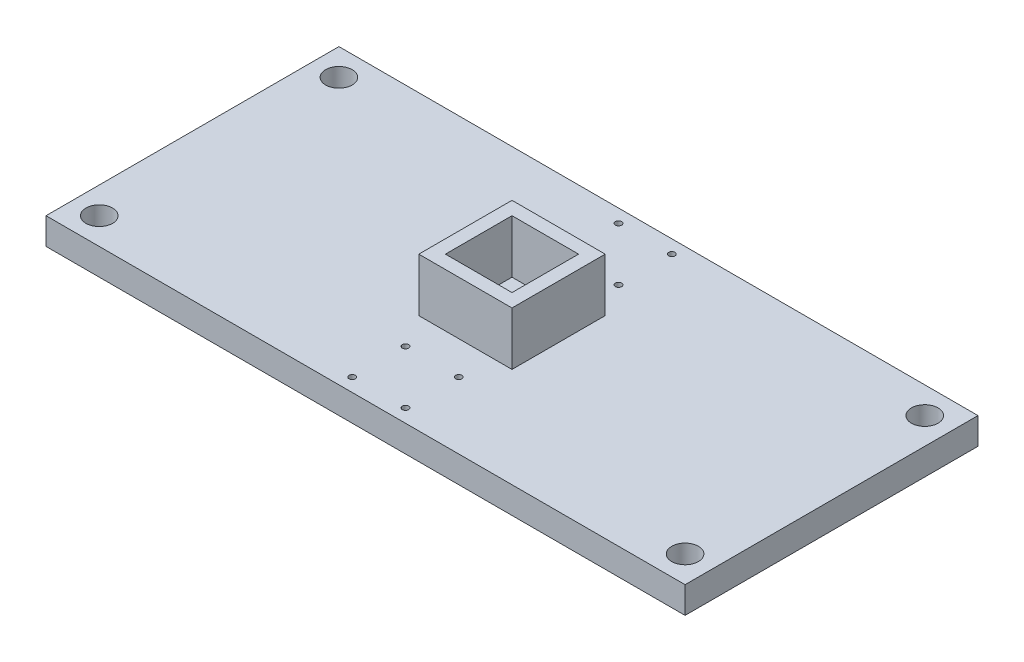
ISO-10303-21;
HEADER;
FILE_DESCRIPTION(('STEP AP214'),'2;1');
FILE_NAME('part.step','',(''),(''),'','','');
FILE_SCHEMA(('AUTOMOTIVE_DESIGN { 1 0 10303 214 1 1 1 1 }'));
ENDSEC;
DATA;
#1=APPLICATION_CONTEXT('core data for automotive mechanical design processes');
#2=APPLICATION_PROTOCOL_DEFINITION('international standard','automotive_design',2000,#1);
#3=PRODUCT_CONTEXT('',#1,'mechanical');
#4=PRODUCT('Part','Part','',(#3));
#5=PRODUCT_RELATED_PRODUCT_CATEGORY('part','',(#4));
#6=PRODUCT_DEFINITION_FORMATION('','',#4);
#7=PRODUCT_DEFINITION_CONTEXT('part definition',#1,'design');
#8=PRODUCT_DEFINITION('design','',#6,#7);
#9=PRODUCT_DEFINITION_SHAPE('','',#8);
#10=(LENGTH_UNIT() NAMED_UNIT(*) SI_UNIT(.MILLI.,.METRE.));
#11=(NAMED_UNIT(*) PLANE_ANGLE_UNIT() SI_UNIT($,.RADIAN.));
#12=(NAMED_UNIT(*) SI_UNIT($,.STERADIAN.) SOLID_ANGLE_UNIT());
#13=UNCERTAINTY_MEASURE_WITH_UNIT(LENGTH_MEASURE(1.E-05),#10,'distance_accuracy_value','');
#14=(GEOMETRIC_REPRESENTATION_CONTEXT(3) GLOBAL_UNCERTAINTY_ASSIGNED_CONTEXT((#13)) GLOBAL_UNIT_ASSIGNED_CONTEXT((#10,
#11,#12)) REPRESENTATION_CONTEXT('',''));
#15=CARTESIAN_POINT('',(0.,0.,0.));
#16=DIRECTION('',(0.,0.,1.));
#17=DIRECTION('',(1.,0.,0.));
#18=AXIS2_PLACEMENT_3D('',#15,#16,#17);
#19=CARTESIAN_POINT('',(0.,12.7,0.));
#20=DIRECTION('',(0.,-1.,0.));
#21=DIRECTION('',(0.,0.,-1.));
#22=AXIS2_PLACEMENT_3D('',#19,#20,#21);
#23=PLANE('',#22);
#24=CARTESIAN_POINT('',(292.1,12.7,-127.));
#25=DIRECTION('',(0.,-1.,0.));
#26=DIRECTION('',(0.,0.,1.));
#27=AXIS2_PLACEMENT_3D('',#24,#25,#26);
#28=CIRCLE('',#27,6.34999999999994);
#29=CARTESIAN_POINT('',(292.1,12.7,-120.65));
#30=VERTEX_POINT('',#29);
#31=EDGE_CURVE('E475',#30,#30,#28,.T.);
#32=ORIENTED_EDGE('',*,*,#31,.T.);
#33=EDGE_LOOP('',(#32));
#34=FACE_BOUND('',#33,.T.);
#35=CARTESIAN_POINT('',(12.7,12.7,-127.));
#36=DIRECTION('',(0.,-1.,0.));
#37=DIRECTION('',(0.,0.,-1.));
#38=AXIS2_PLACEMENT_3D('',#35,#36,#37);
#39=CIRCLE('',#38,6.35);
#40=CARTESIAN_POINT('',(12.7,12.7,-133.35));
#41=VERTEX_POINT('',#40);
#42=EDGE_CURVE('E480',#41,#41,#39,.T.);
#43=ORIENTED_EDGE('',*,*,#42,.T.);
#44=EDGE_LOOP('',(#43));
#45=FACE_BOUND('',#44,.T.);
#46=CARTESIAN_POINT('',(139.7,12.7,-107.95));
#47=DIRECTION('',(0.,-1.,0.));
#48=DIRECTION('',(0.,0.,-1.));
#49=AXIS2_PLACEMENT_3D('',#46,#47,#48);
#50=CIRCLE('',#49,1.5);
#51=CARTESIAN_POINT('',(139.7,12.7,-109.45));
#52=VERTEX_POINT('',#51);
#53=EDGE_CURVE('E486',#52,#52,#50,.T.);
#54=ORIENTED_EDGE('',*,*,#53,.T.);
#55=EDGE_LOOP('',(#54));
#56=FACE_BOUND('',#55,.T.);
#57=CARTESIAN_POINT('',(165.1,12.7,-107.95));
#58=DIRECTION('',(0.,-1.,0.));
#59=DIRECTION('',(0.,0.,-1.));
#60=AXIS2_PLACEMENT_3D('',#57,#58,#59);
#61=CIRCLE('',#60,1.5);
#62=CARTESIAN_POINT('',(165.1,12.7,-109.45));
#63=VERTEX_POINT('',#62);
#64=EDGE_CURVE('E492',#63,#63,#61,.T.);
#65=ORIENTED_EDGE('',*,*,#64,.T.);
#66=EDGE_LOOP('',(#65));
#67=FACE_BOUND('',#66,.T.);
#68=CARTESIAN_POINT('',(165.1,12.7,-133.35));
#69=DIRECTION('',(0.,-1.,0.));
#70=DIRECTION('',(0.,0.,-1.));
#71=AXIS2_PLACEMENT_3D('',#68,#69,#70);
#72=CIRCLE('',#71,1.5);
#73=CARTESIAN_POINT('',(165.1,12.7,-134.85));
#74=VERTEX_POINT('',#73);
#75=EDGE_CURVE('E498',#74,#74,#72,.T.);
#76=ORIENTED_EDGE('',*,*,#75,.T.);
#77=EDGE_LOOP('',(#76));
#78=FACE_BOUND('',#77,.T.);
#79=CARTESIAN_POINT('',(139.7,12.7,-133.35));
#80=DIRECTION('',(0.,-1.,0.));
#81=DIRECTION('',(0.,0.,-1.));
#82=AXIS2_PLACEMENT_3D('',#79,#80,#81);
#83=CIRCLE('',#82,1.5);
#84=CARTESIAN_POINT('',(139.7,12.7,-134.85));
#85=VERTEX_POINT('',#84);
#86=EDGE_CURVE('E470',#85,#85,#83,.T.);
#87=ORIENTED_EDGE('',*,*,#86,.T.);
#88=EDGE_LOOP('',(#87));
#89=FACE_BOUND('',#88,.T.);
#90=CARTESIAN_POINT('',(292.1,12.7,-12.7));
#91=DIRECTION('',(0.,1.,0.));
#92=DIRECTION('',(0.,0.,-1.));
#93=AXIS2_PLACEMENT_3D('',#90,#91,#92);
#94=CIRCLE('',#93,6.34999999999994);
#95=CARTESIAN_POINT('',(292.1,12.7,-19.0499999999999));
#96=VERTEX_POINT('',#95);
#97=EDGE_CURVE('E223',#96,#96,#94,.T.);
#98=ORIENTED_EDGE('',*,*,#97,.F.);
#99=EDGE_LOOP('',(#98));
#100=FACE_BOUND('',#99,.T.);
#101=CARTESIAN_POINT('',(12.7,12.7,-12.7));
#102=DIRECTION('',(0.,1.,0.));
#103=DIRECTION('',(0.,0.,1.));
#104=AXIS2_PLACEMENT_3D('',#101,#102,#103);
#105=CIRCLE('',#104,6.35);
#106=CARTESIAN_POINT('',(12.7,12.7,-6.35));
#107=VERTEX_POINT('',#106);
#108=EDGE_CURVE('E253',#107,#107,#105,.T.);
#109=ORIENTED_EDGE('',*,*,#108,.F.);
#110=EDGE_LOOP('',(#109));
#111=FACE_BOUND('',#110,.T.);
#112=CARTESIAN_POINT('',(139.7,12.7,-31.75));
#113=DIRECTION('',(0.,1.,0.));
#114=DIRECTION('',(0.,0.,1.));
#115=AXIS2_PLACEMENT_3D('',#112,#113,#114);
#116=CIRCLE('',#115,1.5);
#117=CARTESIAN_POINT('',(139.7,12.7,-30.25));
#118=VERTEX_POINT('',#117);
#119=EDGE_CURVE('E245',#118,#118,#116,.T.);
#120=ORIENTED_EDGE('',*,*,#119,.F.);
#121=EDGE_LOOP('',(#120));
#122=FACE_BOUND('',#121,.T.);
#123=CARTESIAN_POINT('',(165.1,12.7,-31.75));
#124=DIRECTION('',(0.,1.,0.));
#125=DIRECTION('',(0.,0.,1.));
#126=AXIS2_PLACEMENT_3D('',#123,#124,#125);
#127=CIRCLE('',#126,1.5);
#128=CARTESIAN_POINT('',(165.1,12.7,-30.25));
#129=VERTEX_POINT('',#128);
#130=EDGE_CURVE('E237',#129,#129,#127,.T.);
#131=ORIENTED_EDGE('',*,*,#130,.F.);
#132=EDGE_LOOP('',(#131));
#133=FACE_BOUND('',#132,.T.);
#134=CARTESIAN_POINT('',(165.1,12.7,-6.35000000000001));
#135=DIRECTION('',(0.,1.,0.));
#136=DIRECTION('',(0.,0.,1.));
#137=AXIS2_PLACEMENT_3D('',#134,#135,#136);
#138=CIRCLE('',#137,1.5);
#139=CARTESIAN_POINT('',(165.1,12.7,-4.85000000000001));
#140=VERTEX_POINT('',#139);
#141=EDGE_CURVE('E229',#140,#140,#138,.T.);
#142=ORIENTED_EDGE('',*,*,#141,.F.);
#143=EDGE_LOOP('',(#142));
#144=FACE_BOUND('',#143,.T.);
#145=CARTESIAN_POINT('',(139.7,12.7,-6.35000000000001));
#146=DIRECTION('',(0.,1.,0.));
#147=DIRECTION('',(0.,0.,1.));
#148=AXIS2_PLACEMENT_3D('',#145,#146,#147);
#149=CIRCLE('',#148,1.5);
#150=CARTESIAN_POINT('',(139.7,12.7,-4.85000000000001));
#151=VERTEX_POINT('',#150);
#152=EDGE_CURVE('E228',#151,#151,#149,.T.);
#153=ORIENTED_EDGE('',*,*,#152,.F.);
#154=EDGE_LOOP('',(#153));
#155=FACE_BOUND('',#154,.T.);
#156=DIRECTION('',(0.,0.,1.));
#157=VECTOR('',#156,1.);
#158=CARTESIAN_POINT('',(0.,12.7,0.));
#159=LINE('',#158,#157);
#160=CARTESIAN_POINT('',(0.,12.7,-139.7));
#161=VERTEX_POINT('',#160);
#162=CARTESIAN_POINT('',(0.,12.7,0.));
#163=VERTEX_POINT('',#162);
#164=EDGE_CURVE('E272',#161,#163,#159,.T.);
#165=ORIENTED_EDGE('',*,*,#164,.T.);
#166=DIRECTION('',(1.,0.,0.));
#167=VECTOR('',#166,1.);
#168=CARTESIAN_POINT('',(0.,12.7,0.));
#169=LINE('',#168,#167);
#170=CARTESIAN_POINT('',(304.8,12.7,0.));
#171=VERTEX_POINT('',#170);
#172=EDGE_CURVE('E276',#163,#171,#169,.T.);
#173=ORIENTED_EDGE('',*,*,#172,.T.);
#174=DIRECTION('',(0.,0.,-1.));
#175=VECTOR('',#174,1.);
#176=CARTESIAN_POINT('',(304.8,12.7,0.));
#177=LINE('',#176,#175);
#178=CARTESIAN_POINT('',(304.8,12.7,-139.7));
#179=VERTEX_POINT('',#178);
#180=EDGE_CURVE('E280',#171,#179,#177,.T.);
#181=ORIENTED_EDGE('',*,*,#180,.T.);
#182=DIRECTION('',(-1.,0.,0.));
#183=VECTOR('',#182,1.);
#184=CARTESIAN_POINT('',(0.,12.7,-139.7));
#185=LINE('',#184,#183);
#186=EDGE_CURVE('E283',#179,#161,#185,.T.);
#187=ORIENTED_EDGE('',*,*,#186,.T.);
#188=EDGE_LOOP('',(#165,#173,#181,#187));
#189=FACE_BOUND('',#188,.T.);
#190=DIRECTION('',(0.,0.,1.));
#191=VECTOR('',#190,1.);
#192=CARTESIAN_POINT('',(130.175,12.7,-47.625));
#193=LINE('',#192,#191);
#194=CARTESIAN_POINT('',(130.175,12.7,-92.075));
#195=VERTEX_POINT('',#194);
#196=CARTESIAN_POINT('',(130.175,12.7,-47.625));
#197=VERTEX_POINT('',#196);
#198=EDGE_CURVE('E148',#195,#197,#193,.T.);
#199=ORIENTED_EDGE('',*,*,#198,.F.);
#200=DIRECTION('',(-1.,0.,0.));
#201=VECTOR('',#200,1.);
#202=CARTESIAN_POINT('',(130.175,12.7,-92.075));
#203=LINE('',#202,#201);
#204=CARTESIAN_POINT('',(174.625,12.7,-92.075));
#205=VERTEX_POINT('',#204);
#206=EDGE_CURVE('E189',#205,#195,#203,.T.);
#207=ORIENTED_EDGE('',*,*,#206,.F.);
#208=DIRECTION('',(0.,0.,-1.));
#209=VECTOR('',#208,1.);
#210=CARTESIAN_POINT('',(174.625,12.7,-47.625));
#211=LINE('',#210,#209);
#212=CARTESIAN_POINT('',(174.625,12.7,-47.625));
#213=VERTEX_POINT('',#212);
#214=EDGE_CURVE('E60',#213,#205,#211,.T.);
#215=ORIENTED_EDGE('',*,*,#214,.F.);
#216=DIRECTION('',(1.,0.,0.));
#217=VECTOR('',#216,1.);
#218=CARTESIAN_POINT('',(130.175,12.7,-47.625));
#219=LINE('',#218,#217);
#220=EDGE_CURVE('E55',#197,#213,#219,.T.);
#221=ORIENTED_EDGE('',*,*,#220,.F.);
#222=EDGE_LOOP('',(#199,#207,#215,#221));
#223=FACE_BOUND('',#222,.T.);
#224=ADVANCED_FACE('F39',(#34,#45,#56,#67,#78,#89,#100,#111,#122,#133,#144,#155,#189,#223),#23,.F.);
#225=CARTESIAN_POINT('',(0.,12.7,0.));
#226=DIRECTION('',(1.,0.,0.));
#227=DIRECTION('',(0.,0.,-1.));
#228=AXIS2_PLACEMENT_3D('',#225,#226,#227);
#229=PLANE('',#228);
#230=DIRECTION('',(0.,0.,1.));
#231=VECTOR('',#230,1.);
#232=CARTESIAN_POINT('',(0.,0.,0.));
#233=LINE('',#232,#231);
#234=CARTESIAN_POINT('',(0.,0.,-139.7));
#235=VERTEX_POINT('',#234);
#236=CARTESIAN_POINT('',(0.,0.,0.));
#237=VERTEX_POINT('',#236);
#238=EDGE_CURVE('E268',#235,#237,#233,.T.);
#239=ORIENTED_EDGE('',*,*,#238,.T.);
#240=DIRECTION('',(0.,-1.,0.));
#241=VECTOR('',#240,1.);
#242=CARTESIAN_POINT('',(0.,12.7,0.));
#243=LINE('',#242,#241);
#244=EDGE_CURVE('E11',#163,#237,#243,.T.);
#245=ORIENTED_EDGE('',*,*,#244,.F.);
#246=ORIENTED_EDGE('',*,*,#164,.F.);
#247=DIRECTION('',(0.,-1.,0.));
#248=VECTOR('',#247,1.);
#249=CARTESIAN_POINT('',(0.,12.7,-139.7));
#250=LINE('',#249,#248);
#251=EDGE_CURVE('E286',#161,#235,#250,.T.);
#252=ORIENTED_EDGE('',*,*,#251,.T.);
#253=EDGE_LOOP('',(#239,#245,#246,#252));
#254=FACE_BOUND('',#253,.T.);
#255=ADVANCED_FACE('F41',(#254),#229,.F.);
#256=CARTESIAN_POINT('',(0.,12.7,0.));
#257=DIRECTION('',(0.,0.,-1.));
#258=DIRECTION('',(-1.,0.,0.));
#259=AXIS2_PLACEMENT_3D('',#256,#257,#258);
#260=PLANE('',#259);
#261=DIRECTION('',(1.,0.,0.));
#262=VECTOR('',#261,1.);
#263=CARTESIAN_POINT('',(0.,0.,0.));
#264=LINE('',#263,#262);
#265=CARTESIAN_POINT('',(304.8,0.,0.));
#266=VERTEX_POINT('',#265);
#267=EDGE_CURVE('E290',#237,#266,#264,.T.);
#268=ORIENTED_EDGE('',*,*,#267,.T.);
#269=DIRECTION('',(0.,-1.,0.));
#270=VECTOR('',#269,1.);
#271=CARTESIAN_POINT('',(304.8,12.7,0.));
#272=LINE('',#271,#270);
#273=EDGE_CURVE('E48',#171,#266,#272,.T.);
#274=ORIENTED_EDGE('',*,*,#273,.F.);
#275=ORIENTED_EDGE('',*,*,#172,.F.);
#276=ORIENTED_EDGE('',*,*,#244,.T.);
#277=EDGE_LOOP('',(#268,#274,#275,#276));
#278=FACE_BOUND('',#277,.T.);
#279=ADVANCED_FACE('F325',(#278),#260,.F.);
#280=CARTESIAN_POINT('',(304.8,12.7,0.));
#281=DIRECTION('',(-1.,0.,0.));
#282=DIRECTION('',(0.,0.,1.));
#283=AXIS2_PLACEMENT_3D('',#280,#281,#282);
#284=PLANE('',#283);
#285=DIRECTION('',(0.,0.,-1.));
#286=VECTOR('',#285,1.);
#287=CARTESIAN_POINT('',(304.8,0.,0.));
#288=LINE('',#287,#286);
#289=CARTESIAN_POINT('',(304.8,0.,-139.7));
#290=VERTEX_POINT('',#289);
#291=EDGE_CURVE('E293',#266,#290,#288,.T.);
#292=ORIENTED_EDGE('',*,*,#291,.T.);
#293=DIRECTION('',(0.,-1.,0.));
#294=VECTOR('',#293,1.);
#295=CARTESIAN_POINT('',(304.8,12.7,-139.7));
#296=LINE('',#295,#294);
#297=EDGE_CURVE('E301',#179,#290,#296,.T.);
#298=ORIENTED_EDGE('',*,*,#297,.F.);
#299=ORIENTED_EDGE('',*,*,#180,.F.);
#300=ORIENTED_EDGE('',*,*,#273,.T.);
#301=EDGE_LOOP('',(#292,#298,#299,#300));
#302=FACE_BOUND('',#301,.T.);
#303=ADVANCED_FACE('F310',(#302),#284,.F.);
#304=CARTESIAN_POINT('',(0.,12.7,-139.7));
#305=DIRECTION('',(0.,0.,1.));
#306=DIRECTION('',(1.,0.,0.));
#307=AXIS2_PLACEMENT_3D('',#304,#305,#306);
#308=PLANE('',#307);
#309=DIRECTION('',(-1.,0.,0.));
#310=VECTOR('',#309,1.);
#311=CARTESIAN_POINT('',(0.,0.,-139.7));
#312=LINE('',#311,#310);
#313=EDGE_CURVE('E277',#290,#235,#312,.T.);
#314=ORIENTED_EDGE('',*,*,#313,.T.);
#315=ORIENTED_EDGE('',*,*,#251,.F.);
#316=ORIENTED_EDGE('',*,*,#186,.F.);
#317=ORIENTED_EDGE('',*,*,#297,.T.);
#318=EDGE_LOOP('',(#314,#315,#316,#317));
#319=FACE_BOUND('',#318,.T.);
#320=ADVANCED_FACE('F319',(#319),#308,.F.);
#321=CARTESIAN_POINT('',(0.,0.,0.));
#322=DIRECTION('',(0.,-1.,0.));
#323=DIRECTION('',(0.,0.,-1.));
#324=AXIS2_PLACEMENT_3D('',#321,#322,#323);
#325=PLANE('',#324);
#326=CARTESIAN_POINT('',(292.1,0.,-127.));
#327=DIRECTION('',(0.,-1.,0.));
#328=DIRECTION('',(0.,0.,1.));
#329=AXIS2_PLACEMENT_3D('',#326,#327,#328);
#330=CIRCLE('',#329,6.34999999999994);
#331=CARTESIAN_POINT('',(292.1,0.,-120.65));
#332=VERTEX_POINT('',#331);
#333=EDGE_CURVE('E425',#332,#332,#330,.T.);
#334=ORIENTED_EDGE('',*,*,#333,.F.);
#335=EDGE_LOOP('',(#334));
#336=FACE_BOUND('',#335,.T.);
#337=CARTESIAN_POINT('',(12.7,0.,-127.));
#338=DIRECTION('',(0.,-1.,0.));
#339=DIRECTION('',(0.,0.,-1.));
#340=AXIS2_PLACEMENT_3D('',#337,#338,#339);
#341=CIRCLE('',#340,6.35);
#342=CARTESIAN_POINT('',(12.7,0.,-133.35));
#343=VERTEX_POINT('',#342);
#344=EDGE_CURVE('E429',#343,#343,#341,.T.);
#345=ORIENTED_EDGE('',*,*,#344,.F.);
#346=EDGE_LOOP('',(#345));
#347=FACE_BOUND('',#346,.T.);
#348=CARTESIAN_POINT('',(139.7,0.,-107.95));
#349=DIRECTION('',(0.,-1.,0.));
#350=DIRECTION('',(0.,0.,-1.));
#351=AXIS2_PLACEMENT_3D('',#348,#349,#350);
#352=CIRCLE('',#351,1.5);
#353=CARTESIAN_POINT('',(139.7,0.,-109.45));
#354=VERTEX_POINT('',#353);
#355=EDGE_CURVE('E433',#354,#354,#352,.T.);
#356=ORIENTED_EDGE('',*,*,#355,.F.);
#357=EDGE_LOOP('',(#356));
#358=FACE_BOUND('',#357,.T.);
#359=CARTESIAN_POINT('',(165.1,0.,-107.95));
#360=DIRECTION('',(0.,-1.,0.));
#361=DIRECTION('',(0.,0.,-1.));
#362=AXIS2_PLACEMENT_3D('',#359,#360,#361);
#363=CIRCLE('',#362,1.5);
#364=CARTESIAN_POINT('',(165.1,0.,-109.45));
#365=VERTEX_POINT('',#364);
#366=EDGE_CURVE('E437',#365,#365,#363,.T.);
#367=ORIENTED_EDGE('',*,*,#366,.F.);
#368=EDGE_LOOP('',(#367));
#369=FACE_BOUND('',#368,.T.);
#370=CARTESIAN_POINT('',(165.1,0.,-133.35));
#371=DIRECTION('',(0.,-1.,0.));
#372=DIRECTION('',(0.,0.,-1.));
#373=AXIS2_PLACEMENT_3D('',#370,#371,#372);
#374=CIRCLE('',#373,1.5);
#375=CARTESIAN_POINT('',(165.1,0.,-134.85));
#376=VERTEX_POINT('',#375);
#377=EDGE_CURVE('E441',#376,#376,#374,.T.);
#378=ORIENTED_EDGE('',*,*,#377,.F.);
#379=EDGE_LOOP('',(#378));
#380=FACE_BOUND('',#379,.T.);
#381=CARTESIAN_POINT('',(139.7,0.,-133.35));
#382=DIRECTION('',(0.,-1.,0.));
#383=DIRECTION('',(0.,0.,-1.));
#384=AXIS2_PLACEMENT_3D('',#381,#382,#383);
#385=CIRCLE('',#384,1.5);
#386=CARTESIAN_POINT('',(139.7,0.,-134.85));
#387=VERTEX_POINT('',#386);
#388=EDGE_CURVE('E167',#387,#387,#385,.T.);
#389=ORIENTED_EDGE('',*,*,#388,.F.);
#390=EDGE_LOOP('',(#389));
#391=FACE_BOUND('',#390,.T.);
#392=CARTESIAN_POINT('',(292.1,0.,-12.7));
#393=DIRECTION('',(0.,1.,0.));
#394=DIRECTION('',(0.,0.,-1.));
#395=AXIS2_PLACEMENT_3D('',#392,#393,#394);
#396=CIRCLE('',#395,6.34999999999994);
#397=CARTESIAN_POINT('',(292.1,0.,-19.0499999999999));
#398=VERTEX_POINT('',#397);
#399=EDGE_CURVE('E257',#398,#398,#396,.T.);
#400=ORIENTED_EDGE('',*,*,#399,.T.);
#401=EDGE_LOOP('',(#400));
#402=FACE_BOUND('',#401,.T.);
#403=CARTESIAN_POINT('',(12.7,0.,-12.7));
#404=DIRECTION('',(0.,1.,0.));
#405=DIRECTION('',(0.,0.,1.));
#406=AXIS2_PLACEMENT_3D('',#403,#404,#405);
#407=CIRCLE('',#406,6.35);
#408=CARTESIAN_POINT('',(12.7,0.,-6.35));
#409=VERTEX_POINT('',#408);
#410=EDGE_CURVE('E249',#409,#409,#407,.T.);
#411=ORIENTED_EDGE('',*,*,#410,.T.);
#412=EDGE_LOOP('',(#411));
#413=FACE_BOUND('',#412,.T.);
#414=CARTESIAN_POINT('',(139.7,0.,-31.75));
#415=DIRECTION('',(0.,1.,0.));
#416=DIRECTION('',(0.,0.,1.));
#417=AXIS2_PLACEMENT_3D('',#414,#415,#416);
#418=CIRCLE('',#417,1.5);
#419=CARTESIAN_POINT('',(139.7,0.,-30.25));
#420=VERTEX_POINT('',#419);
#421=EDGE_CURVE('E241',#420,#420,#418,.T.);
#422=ORIENTED_EDGE('',*,*,#421,.T.);
#423=EDGE_LOOP('',(#422));
#424=FACE_BOUND('',#423,.T.);
#425=CARTESIAN_POINT('',(165.1,0.,-31.75));
#426=DIRECTION('',(0.,1.,0.));
#427=DIRECTION('',(0.,0.,1.));
#428=AXIS2_PLACEMENT_3D('',#425,#426,#427);
#429=CIRCLE('',#428,1.5);
#430=CARTESIAN_POINT('',(165.1,0.,-30.25));
#431=VERTEX_POINT('',#430);
#432=EDGE_CURVE('E233',#431,#431,#429,.T.);
#433=ORIENTED_EDGE('',*,*,#432,.T.);
#434=EDGE_LOOP('',(#433));
#435=FACE_BOUND('',#434,.T.);
#436=CARTESIAN_POINT('',(165.1,0.,-6.35000000000001));
#437=DIRECTION('',(0.,1.,0.));
#438=DIRECTION('',(0.,0.,1.));
#439=AXIS2_PLACEMENT_3D('',#436,#437,#438);
#440=CIRCLE('',#439,1.5);
#441=CARTESIAN_POINT('',(165.1,0.,-4.85000000000001));
#442=VERTEX_POINT('',#441);
#443=EDGE_CURVE('E224',#442,#442,#440,.T.);
#444=ORIENTED_EDGE('',*,*,#443,.T.);
#445=EDGE_LOOP('',(#444));
#446=FACE_BOUND('',#445,.T.);
#447=CARTESIAN_POINT('',(139.7,0.,-6.35000000000001));
#448=DIRECTION('',(0.,1.,0.));
#449=DIRECTION('',(0.,0.,1.));
#450=AXIS2_PLACEMENT_3D('',#447,#448,#449);
#451=CIRCLE('',#450,1.5);
#452=CARTESIAN_POINT('',(139.7,0.,-4.85000000000001));
#453=VERTEX_POINT('',#452);
#454=EDGE_CURVE('E264',#453,#453,#451,.T.);
#455=ORIENTED_EDGE('',*,*,#454,.T.);
#456=EDGE_LOOP('',(#455));
#457=FACE_BOUND('',#456,.T.);
#458=ORIENTED_EDGE('',*,*,#238,.F.);
#459=ORIENTED_EDGE('',*,*,#313,.F.);
#460=ORIENTED_EDGE('',*,*,#291,.F.);
#461=ORIENTED_EDGE('',*,*,#267,.F.);
#462=EDGE_LOOP('',(#458,#459,#460,#461));
#463=FACE_BOUND('',#462,.T.);
#464=ADVANCED_FACE('F316',(#336,#347,#358,#369,#380,#391,#402,#413,#424,#435,#446,#457,#463),
#325,.T.);
#465=CARTESIAN_POINT('',(139.7,0.,-6.35000000000001));
#466=DIRECTION('',(0.,1.,0.));
#467=DIRECTION('',(0.,0.,1.));
#468=AXIS2_PLACEMENT_3D('',#465,#466,#467);
#469=CYLINDRICAL_SURFACE('',#468,1.5);
#470=ORIENTED_EDGE('',*,*,#454,.F.);
#471=EDGE_LOOP('',(#470));
#472=FACE_BOUND('',#471,.T.);
#473=ORIENTED_EDGE('',*,*,#152,.T.);
#474=EDGE_LOOP('',(#473));
#475=FACE_BOUND('',#474,.T.);
#476=ADVANCED_FACE('F392',(#472,#475),#469,.F.);
#477=CARTESIAN_POINT('',(165.1,0.,-6.35000000000001));
#478=DIRECTION('',(0.,1.,0.));
#479=DIRECTION('',(0.,0.,1.));
#480=AXIS2_PLACEMENT_3D('',#477,#478,#479);
#481=CYLINDRICAL_SURFACE('',#480,1.5);
#482=ORIENTED_EDGE('',*,*,#443,.F.);
#483=EDGE_LOOP('',(#482));
#484=FACE_BOUND('',#483,.T.);
#485=ORIENTED_EDGE('',*,*,#141,.T.);
#486=EDGE_LOOP('',(#485));
#487=FACE_BOUND('',#486,.T.);
#488=ADVANCED_FACE('F388',(#484,#487),#481,.F.);
#489=CARTESIAN_POINT('',(165.1,0.,-31.75));
#490=DIRECTION('',(0.,1.,0.));
#491=DIRECTION('',(0.,0.,1.));
#492=AXIS2_PLACEMENT_3D('',#489,#490,#491);
#493=CYLINDRICAL_SURFACE('',#492,1.5);
#494=ORIENTED_EDGE('',*,*,#432,.F.);
#495=EDGE_LOOP('',(#494));
#496=FACE_BOUND('',#495,.T.);
#497=ORIENTED_EDGE('',*,*,#130,.T.);
#498=EDGE_LOOP('',(#497));
#499=FACE_BOUND('',#498,.T.);
#500=ADVANCED_FACE('F391',(#496,#499),#493,.F.);
#501=CARTESIAN_POINT('',(139.7,0.,-31.75));
#502=DIRECTION('',(0.,1.,0.));
#503=DIRECTION('',(0.,0.,1.));
#504=AXIS2_PLACEMENT_3D('',#501,#502,#503);
#505=CYLINDRICAL_SURFACE('',#504,1.5);
#506=ORIENTED_EDGE('',*,*,#421,.F.);
#507=EDGE_LOOP('',(#506));
#508=FACE_BOUND('',#507,.T.);
#509=ORIENTED_EDGE('',*,*,#119,.T.);
#510=EDGE_LOOP('',(#509));
#511=FACE_BOUND('',#510,.T.);
#512=ADVANCED_FACE('F396',(#508,#511),#505,.F.);
#513=CARTESIAN_POINT('',(12.7,0.,-12.7));
#514=DIRECTION('',(0.,1.,0.));
#515=DIRECTION('',(0.,0.,1.));
#516=AXIS2_PLACEMENT_3D('',#513,#514,#515);
#517=CYLINDRICAL_SURFACE('',#516,6.35);
#518=ORIENTED_EDGE('',*,*,#410,.F.);
#519=EDGE_LOOP('',(#518));
#520=FACE_BOUND('',#519,.T.);
#521=ORIENTED_EDGE('',*,*,#108,.T.);
#522=EDGE_LOOP('',(#521));
#523=FACE_BOUND('',#522,.T.);
#524=ADVANCED_FACE('F400',(#520,#523),#517,.F.);
#525=CARTESIAN_POINT('',(292.1,0.,-12.7));
#526=DIRECTION('',(0.,1.,0.));
#527=DIRECTION('',(0.,0.,1.));
#528=AXIS2_PLACEMENT_3D('',#525,#526,#527);
#529=CYLINDRICAL_SURFACE('',#528,6.34999999999994);
#530=ORIENTED_EDGE('',*,*,#399,.F.);
#531=EDGE_LOOP('',(#530));
#532=FACE_BOUND('',#531,.T.);
#533=ORIENTED_EDGE('',*,*,#97,.T.);
#534=EDGE_LOOP('',(#533));
#535=FACE_BOUND('',#534,.T.);
#536=ADVANCED_FACE('F372',(#532,#535),#529,.F.);
#537=CARTESIAN_POINT('',(0.,38.1,0.));
#538=DIRECTION('',(0.,-1.,0.));
#539=DIRECTION('',(0.,0.,-1.));
#540=AXIS2_PLACEMENT_3D('',#537,#538,#539);
#541=PLANE('',#540);
#542=DIRECTION('',(0.,0.,1.));
#543=VECTOR('',#542,1.);
#544=CARTESIAN_POINT('',(130.175,38.1,-47.625));
#545=LINE('',#544,#543);
#546=CARTESIAN_POINT('',(130.175,38.1,-92.075));
#547=VERTEX_POINT('',#546);
#548=CARTESIAN_POINT('',(130.175,38.1,-47.625));
#549=VERTEX_POINT('',#548);
#550=EDGE_CURVE('E184',#547,#549,#545,.T.);
#551=ORIENTED_EDGE('',*,*,#550,.T.);
#552=DIRECTION('',(1.,0.,0.));
#553=VECTOR('',#552,1.);
#554=CARTESIAN_POINT('',(130.175,38.1,-47.625));
#555=LINE('',#554,#553);
#556=CARTESIAN_POINT('',(174.625,38.1,-47.625));
#557=VERTEX_POINT('',#556);
#558=EDGE_CURVE('E188',#549,#557,#555,.T.);
#559=ORIENTED_EDGE('',*,*,#558,.T.);
#560=DIRECTION('',(0.,0.,-1.));
#561=VECTOR('',#560,1.);
#562=CARTESIAN_POINT('',(174.625,38.1,-47.625));
#563=LINE('',#562,#561);
#564=CARTESIAN_POINT('',(174.625,38.1,-92.075));
#565=VERTEX_POINT('',#564);
#566=EDGE_CURVE('E192',#557,#565,#563,.T.);
#567=ORIENTED_EDGE('',*,*,#566,.T.);
#568=DIRECTION('',(-1.,0.,0.));
#569=VECTOR('',#568,1.);
#570=CARTESIAN_POINT('',(130.175,38.1,-92.075));
#571=LINE('',#570,#569);
#572=EDGE_CURVE('E195',#565,#547,#571,.T.);
#573=ORIENTED_EDGE('',*,*,#572,.T.);
#574=EDGE_LOOP('',(#551,#559,#567,#573));
#575=FACE_BOUND('',#574,.T.);
#576=DIRECTION('',(0.,0.,1.));
#577=VECTOR('',#576,1.);
#578=CARTESIAN_POINT('',(136.525,38.1,-53.975));
#579=LINE('',#578,#577);
#580=CARTESIAN_POINT('',(136.525,38.1,-85.725));
#581=VERTEX_POINT('',#580);
#582=CARTESIAN_POINT('',(136.525,38.1,-53.975));
#583=VERTEX_POINT('',#582);
#584=EDGE_CURVE('E128',#581,#583,#579,.T.);
#585=ORIENTED_EDGE('',*,*,#584,.F.);
#586=DIRECTION('',(-1.,0.,0.));
#587=VECTOR('',#586,1.);
#588=CARTESIAN_POINT('',(136.525,38.1,-85.725));
#589=LINE('',#588,#587);
#590=CARTESIAN_POINT('',(168.275,38.1,-85.725));
#591=VERTEX_POINT('',#590);
#592=EDGE_CURVE('E158',#591,#581,#589,.T.);
#593=ORIENTED_EDGE('',*,*,#592,.F.);
#594=DIRECTION('',(0.,0.,-1.));
#595=VECTOR('',#594,1.);
#596=CARTESIAN_POINT('',(168.275,38.1,-53.975));
#597=LINE('',#596,#595);
#598=CARTESIAN_POINT('',(168.275,38.1,-53.975));
#599=VERTEX_POINT('',#598);
#600=EDGE_CURVE('E154',#599,#591,#597,.T.);
#601=ORIENTED_EDGE('',*,*,#600,.F.);
#602=DIRECTION('',(1.,0.,0.));
#603=VECTOR('',#602,1.);
#604=CARTESIAN_POINT('',(136.525,38.1,-53.975));
#605=LINE('',#604,#603);
#606=EDGE_CURVE('E139',#583,#599,#605,.T.);
#607=ORIENTED_EDGE('',*,*,#606,.F.);
#608=EDGE_LOOP('',(#585,#593,#601,#607));
#609=FACE_BOUND('',#608,.T.);
#610=ADVANCED_FACE('F152',(#575,#609),#541,.F.);
#611=CARTESIAN_POINT('',(130.175,38.1,-47.625));
#612=DIRECTION('',(1.,0.,0.));
#613=DIRECTION('',(0.,0.,-1.));
#614=AXIS2_PLACEMENT_3D('',#611,#612,#613);
#615=PLANE('',#614);
#616=ORIENTED_EDGE('',*,*,#198,.T.);
#617=DIRECTION('',(0.,-1.,0.));
#618=VECTOR('',#617,1.);
#619=CARTESIAN_POINT('',(130.175,38.1,-47.625));
#620=LINE('',#619,#618);
#621=EDGE_CURVE('E220',#549,#197,#620,.T.);
#622=ORIENTED_EDGE('',*,*,#621,.F.);
#623=ORIENTED_EDGE('',*,*,#550,.F.);
#624=DIRECTION('',(0.,-1.,0.));
#625=VECTOR('',#624,1.);
#626=CARTESIAN_POINT('',(130.175,38.1,-92.075));
#627=LINE('',#626,#625);
#628=EDGE_CURVE('E198',#547,#195,#627,.T.);
#629=ORIENTED_EDGE('',*,*,#628,.T.);
#630=EDGE_LOOP('',(#616,#622,#623,#629));
#631=FACE_BOUND('',#630,.T.);
#632=ADVANCED_FACE('F371',(#631),#615,.F.);
#633=CARTESIAN_POINT('',(130.175,38.1,-47.625));
#634=DIRECTION('',(0.,0.,-1.));
#635=DIRECTION('',(-1.,0.,0.));
#636=AXIS2_PLACEMENT_3D('',#633,#634,#635);
#637=PLANE('',#636);
#638=ORIENTED_EDGE('',*,*,#220,.T.);
#639=DIRECTION('',(0.,-1.,0.));
#640=VECTOR('',#639,1.);
#641=CARTESIAN_POINT('',(174.625,38.1,-47.625));
#642=LINE('',#641,#640);
#643=EDGE_CURVE('E216',#557,#213,#642,.T.);
#644=ORIENTED_EDGE('',*,*,#643,.F.);
#645=ORIENTED_EDGE('',*,*,#558,.F.);
#646=ORIENTED_EDGE('',*,*,#621,.T.);
#647=EDGE_LOOP('',(#638,#644,#645,#646));
#648=FACE_BOUND('',#647,.T.);
#649=ADVANCED_FACE('F380',(#648),#637,.F.);
#650=CARTESIAN_POINT('',(174.625,38.1,-47.625));
#651=DIRECTION('',(-1.,0.,0.));
#652=DIRECTION('',(0.,0.,1.));
#653=AXIS2_PLACEMENT_3D('',#650,#651,#652);
#654=PLANE('',#653);
#655=ORIENTED_EDGE('',*,*,#214,.T.);
#656=DIRECTION('',(0.,-1.,0.));
#657=VECTOR('',#656,1.);
#658=CARTESIAN_POINT('',(174.625,38.1,-92.075));
#659=LINE('',#658,#657);
#660=EDGE_CURVE('E212',#565,#205,#659,.T.);
#661=ORIENTED_EDGE('',*,*,#660,.F.);
#662=ORIENTED_EDGE('',*,*,#566,.F.);
#663=ORIENTED_EDGE('',*,*,#643,.T.);
#664=EDGE_LOOP('',(#655,#661,#662,#663));
#665=FACE_BOUND('',#664,.T.);
#666=ADVANCED_FACE('F376',(#665),#654,.F.);
#667=CARTESIAN_POINT('',(130.175,38.1,-92.075));
#668=DIRECTION('',(0.,0.,1.));
#669=DIRECTION('',(1.,0.,0.));
#670=AXIS2_PLACEMENT_3D('',#667,#668,#669);
#671=PLANE('',#670);
#672=ORIENTED_EDGE('',*,*,#206,.T.);
#673=ORIENTED_EDGE('',*,*,#628,.F.);
#674=ORIENTED_EDGE('',*,*,#572,.F.);
#675=ORIENTED_EDGE('',*,*,#660,.T.);
#676=EDGE_LOOP('',(#672,#673,#674,#675));
#677=FACE_BOUND('',#676,.T.);
#678=ADVANCED_FACE('F368',(#677),#671,.F.);
#679=CARTESIAN_POINT('',(136.525,38.1,-53.975));
#680=DIRECTION('',(1.,0.,0.));
#681=DIRECTION('',(0.,0.,-1.));
#682=AXIS2_PLACEMENT_3D('',#679,#680,#681);
#683=PLANE('',#682);
#684=DIRECTION('',(0.,0.,1.));
#685=VECTOR('',#684,1.);
#686=CARTESIAN_POINT('',(136.525,12.7,-53.975));
#687=LINE('',#686,#685);
#688=CARTESIAN_POINT('',(136.525,12.7,-85.725));
#689=VERTEX_POINT('',#688);
#690=CARTESIAN_POINT('',(136.525,12.7,-53.975));
#691=VERTEX_POINT('',#690);
#692=EDGE_CURVE('E164',#689,#691,#687,.T.);
#693=ORIENTED_EDGE('',*,*,#692,.F.);
#694=DIRECTION('',(0.,-1.,0.));
#695=VECTOR('',#694,1.);
#696=CARTESIAN_POINT('',(136.525,38.1,-85.725));
#697=LINE('',#696,#695);
#698=EDGE_CURVE('E134',#581,#689,#697,.T.);
#699=ORIENTED_EDGE('',*,*,#698,.F.);
#700=ORIENTED_EDGE('',*,*,#584,.T.);
#701=DIRECTION('',(0.,-1.,0.));
#702=VECTOR('',#701,1.);
#703=CARTESIAN_POINT('',(136.525,38.1,-53.975));
#704=LINE('',#703,#702);
#705=EDGE_CURVE('E132',#583,#691,#704,.T.);
#706=ORIENTED_EDGE('',*,*,#705,.T.);
#707=EDGE_LOOP('',(#693,#699,#700,#706));
#708=FACE_BOUND('',#707,.T.);
#709=ADVANCED_FACE('F131',(#708),#683,.T.);
#710=CARTESIAN_POINT('',(136.525,38.1,-53.975));
#711=DIRECTION('',(0.,0.,-1.));
#712=DIRECTION('',(-1.,0.,0.));
#713=AXIS2_PLACEMENT_3D('',#710,#711,#712);
#714=PLANE('',#713);
#715=DIRECTION('',(1.,0.,0.));
#716=VECTOR('',#715,1.);
#717=CARTESIAN_POINT('',(136.525,12.7,-53.975));
#718=LINE('',#717,#716);
#719=CARTESIAN_POINT('',(168.275,12.7,-53.975));
#720=VERTEX_POINT('',#719);
#721=EDGE_CURVE('E146',#691,#720,#718,.T.);
#722=ORIENTED_EDGE('',*,*,#721,.F.);
#723=ORIENTED_EDGE('',*,*,#705,.F.);
#724=ORIENTED_EDGE('',*,*,#606,.T.);
#725=DIRECTION('',(0.,-1.,0.));
#726=VECTOR('',#725,1.);
#727=CARTESIAN_POINT('',(168.275,38.1,-53.975));
#728=LINE('',#727,#726);
#729=EDGE_CURVE('E149',#599,#720,#728,.T.);
#730=ORIENTED_EDGE('',*,*,#729,.T.);
#731=EDGE_LOOP('',(#722,#723,#724,#730));
#732=FACE_BOUND('',#731,.T.);
#733=ADVANCED_FACE('F143',(#732),#714,.T.);
#734=CARTESIAN_POINT('',(168.275,38.1,-53.975));
#735=DIRECTION('',(-1.,0.,0.));
#736=DIRECTION('',(0.,0.,1.));
#737=AXIS2_PLACEMENT_3D('',#734,#735,#736);
#738=PLANE('',#737);
#739=DIRECTION('',(0.,0.,-1.));
#740=VECTOR('',#739,1.);
#741=CARTESIAN_POINT('',(168.275,12.7,-53.975));
#742=LINE('',#741,#740);
#743=CARTESIAN_POINT('',(168.275,12.7,-85.725));
#744=VERTEX_POINT('',#743);
#745=EDGE_CURVE('E170',#720,#744,#742,.T.);
#746=ORIENTED_EDGE('',*,*,#745,.F.);
#747=ORIENTED_EDGE('',*,*,#729,.F.);
#748=ORIENTED_EDGE('',*,*,#600,.T.);
#749=DIRECTION('',(0.,-1.,0.));
#750=VECTOR('',#749,1.);
#751=CARTESIAN_POINT('',(168.275,38.1,-85.725));
#752=LINE('',#751,#750);
#753=EDGE_CURVE('E179',#591,#744,#752,.T.);
#754=ORIENTED_EDGE('',*,*,#753,.T.);
#755=EDGE_LOOP('',(#746,#747,#748,#754));
#756=FACE_BOUND('',#755,.T.);
#757=ADVANCED_FACE('F353',(#756),#738,.T.);
#758=CARTESIAN_POINT('',(136.525,38.1,-85.725));
#759=DIRECTION('',(0.,0.,1.));
#760=DIRECTION('',(1.,0.,0.));
#761=AXIS2_PLACEMENT_3D('',#758,#759,#760);
#762=PLANE('',#761);
#763=DIRECTION('',(-1.,0.,0.));
#764=VECTOR('',#763,1.);
#765=CARTESIAN_POINT('',(136.525,12.7,-85.725));
#766=LINE('',#765,#764);
#767=EDGE_CURVE('E140',#744,#689,#766,.T.);
#768=ORIENTED_EDGE('',*,*,#767,.F.);
#769=ORIENTED_EDGE('',*,*,#753,.F.);
#770=ORIENTED_EDGE('',*,*,#592,.T.);
#771=ORIENTED_EDGE('',*,*,#698,.T.);
#772=EDGE_LOOP('',(#768,#769,#770,#771));
#773=FACE_BOUND('',#772,.T.);
#774=ADVANCED_FACE('F344',(#773),#762,.T.);
#775=ORIENTED_EDGE('',*,*,#767,.T.);
#776=ORIENTED_EDGE('',*,*,#692,.T.);
#777=ORIENTED_EDGE('',*,*,#721,.T.);
#778=ORIENTED_EDGE('',*,*,#745,.T.);
#779=EDGE_LOOP('',(#775,#776,#777,#778));
#780=FACE_BOUND('',#779,.T.);
#781=ADVANCED_FACE('F335',(#780),#23,.F.);
#782=CARTESIAN_POINT('',(139.7,0.,-133.35));
#783=DIRECTION('',(0.,1.,0.));
#784=DIRECTION('',(0.,0.,1.));
#785=AXIS2_PLACEMENT_3D('',#782,#783,#784);
#786=CYLINDRICAL_SURFACE('',#785,1.5);
#787=ORIENTED_EDGE('',*,*,#388,.T.);
#788=EDGE_LOOP('',(#787));
#789=FACE_BOUND('',#788,.T.);
#790=ORIENTED_EDGE('',*,*,#86,.F.);
#791=EDGE_LOOP('',(#790));
#792=FACE_BOUND('',#791,.T.);
#793=ADVANCED_FACE('F343',(#789,#792),#786,.F.);
#794=CARTESIAN_POINT('',(165.1,0.,-133.35));
#795=DIRECTION('',(0.,1.,0.));
#796=DIRECTION('',(0.,0.,1.));
#797=AXIS2_PLACEMENT_3D('',#794,#795,#796);
#798=CYLINDRICAL_SURFACE('',#797,1.5);
#799=ORIENTED_EDGE('',*,*,#377,.T.);
#800=EDGE_LOOP('',(#799));
#801=FACE_BOUND('',#800,.T.);
#802=ORIENTED_EDGE('',*,*,#75,.F.);
#803=EDGE_LOOP('',(#802));
#804=FACE_BOUND('',#803,.T.);
#805=ADVANCED_FACE('F350',(#801,#804),#798,.F.);
#806=CARTESIAN_POINT('',(165.1,0.,-107.95));
#807=DIRECTION('',(0.,1.,0.));
#808=DIRECTION('',(0.,0.,1.));
#809=AXIS2_PLACEMENT_3D('',#806,#807,#808);
#810=CYLINDRICAL_SURFACE('',#809,1.5);
#811=ORIENTED_EDGE('',*,*,#366,.T.);
#812=EDGE_LOOP('',(#811));
#813=FACE_BOUND('',#812,.T.);
#814=ORIENTED_EDGE('',*,*,#64,.F.);
#815=EDGE_LOOP('',(#814));
#816=FACE_BOUND('',#815,.T.);
#817=ADVANCED_FACE('F506',(#813,#816),#810,.F.);
#818=CARTESIAN_POINT('',(139.7,0.,-107.95));
#819=DIRECTION('',(0.,1.,0.));
#820=DIRECTION('',(0.,0.,1.));
#821=AXIS2_PLACEMENT_3D('',#818,#819,#820);
#822=CYLINDRICAL_SURFACE('',#821,1.5);
#823=ORIENTED_EDGE('',*,*,#355,.T.);
#824=EDGE_LOOP('',(#823));
#825=FACE_BOUND('',#824,.T.);
#826=ORIENTED_EDGE('',*,*,#53,.F.);
#827=EDGE_LOOP('',(#826));
#828=FACE_BOUND('',#827,.T.);
#829=ADVANCED_FACE('F516',(#825,#828),#822,.F.);
#830=CARTESIAN_POINT('',(12.7,0.,-127.));
#831=DIRECTION('',(0.,1.,0.));
#832=DIRECTION('',(0.,0.,1.));
#833=AXIS2_PLACEMENT_3D('',#830,#831,#832);
#834=CYLINDRICAL_SURFACE('',#833,6.35);
#835=ORIENTED_EDGE('',*,*,#344,.T.);
#836=EDGE_LOOP('',(#835));
#837=FACE_BOUND('',#836,.T.);
#838=ORIENTED_EDGE('',*,*,#42,.F.);
#839=EDGE_LOOP('',(#838));
#840=FACE_BOUND('',#839,.T.);
#841=ADVANCED_FACE('F522',(#837,#840),#834,.F.);
#842=CARTESIAN_POINT('',(292.1,0.,-127.));
#843=DIRECTION('',(0.,1.,0.));
#844=DIRECTION('',(0.,0.,1.));
#845=AXIS2_PLACEMENT_3D('',#842,#843,#844);
#846=CYLINDRICAL_SURFACE('',#845,6.34999999999994);
#847=ORIENTED_EDGE('',*,*,#333,.T.);
#848=EDGE_LOOP('',(#847));
#849=FACE_BOUND('',#848,.T.);
#850=ORIENTED_EDGE('',*,*,#31,.F.);
#851=EDGE_LOOP('',(#850));
#852=FACE_BOUND('',#851,.T.);
#853=ADVANCED_FACE('F526',(#849,#852),#846,.F.);
#854=CLOSED_SHELL('',(#224,#255,#279,#303,#320,#464,#476,#488,#500,#512,#524,#536,#610,#632,
#649,#666,#678,#709,#733,#757,#774,#781,#793,#805,#817,#829,#841,#853));
#855=MANIFOLD_SOLID_BREP('B2',#854);
#856=ADVANCED_BREP_SHAPE_REPRESENTATION('',(#18,#855),#14);
#857=SHAPE_DEFINITION_REPRESENTATION(#9,#856);
ENDSEC;
END-ISO-10303-21;
